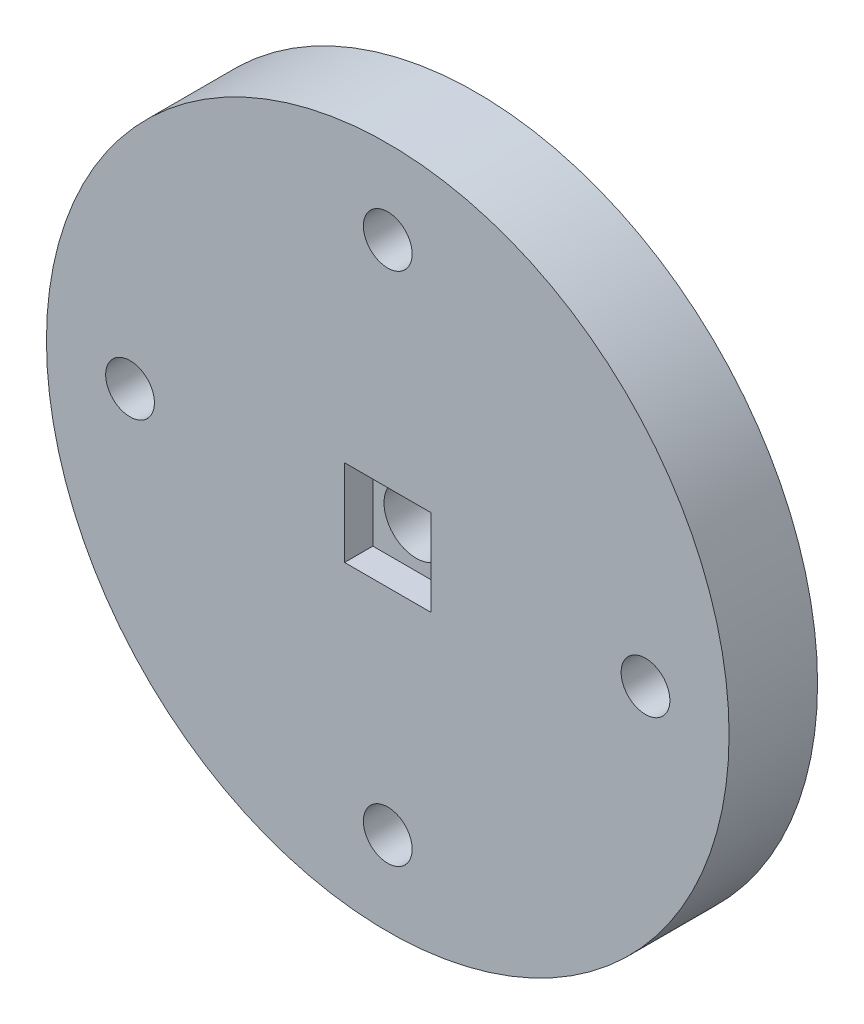
ISO-10303-21;
HEADER;
FILE_DESCRIPTION(('STEP AP214'),'2;1');
FILE_NAME('part.step','',(''),(''),'','','');
FILE_SCHEMA(('AUTOMOTIVE_DESIGN { 1 0 10303 214 1 1 1 1 }'));
ENDSEC;
DATA;
#1=APPLICATION_CONTEXT('core data for automotive mechanical design processes');
#2=APPLICATION_PROTOCOL_DEFINITION('international standard','automotive_design',2000,#1);
#3=PRODUCT_CONTEXT('',#1,'mechanical');
#4=PRODUCT('Part','Part','',(#3));
#5=PRODUCT_RELATED_PRODUCT_CATEGORY('part','',(#4));
#6=PRODUCT_DEFINITION_FORMATION('','',#4);
#7=PRODUCT_DEFINITION_CONTEXT('part definition',#1,'design');
#8=PRODUCT_DEFINITION('design','',#6,#7);
#9=PRODUCT_DEFINITION_SHAPE('','',#8);
#10=(LENGTH_UNIT() NAMED_UNIT(*) SI_UNIT(.MILLI.,.METRE.));
#11=(NAMED_UNIT(*) PLANE_ANGLE_UNIT() SI_UNIT($,.RADIAN.));
#12=(NAMED_UNIT(*) SI_UNIT($,.STERADIAN.) SOLID_ANGLE_UNIT());
#13=UNCERTAINTY_MEASURE_WITH_UNIT(LENGTH_MEASURE(1.E-05),#10,'distance_accuracy_value','');
#14=(GEOMETRIC_REPRESENTATION_CONTEXT(3) GLOBAL_UNCERTAINTY_ASSIGNED_CONTEXT((#13)) GLOBAL_UNIT_ASSIGNED_CONTEXT((#10,
#11,#12)) REPRESENTATION_CONTEXT('',''));
#15=CARTESIAN_POINT('',(0.,0.,0.));
#16=DIRECTION('',(0.,0.,1.));
#17=DIRECTION('',(1.,0.,0.));
#18=AXIS2_PLACEMENT_3D('',#15,#16,#17);
#19=CARTESIAN_POINT('',(0.,3.1,6.35));
#20=DIRECTION('',(0.,-1.,0.));
#21=DIRECTION('',(1.,0.,0.));
#22=AXIS2_PLACEMENT_3D('',#19,#20,#21);
#23=PLANE('',#22);
#24=DIRECTION('',(-1.,0.,0.));
#25=VECTOR('',#24,1.);
#26=CARTESIAN_POINT('',(0.,3.1,4.32));
#27=LINE('',#26,#25);
#28=CARTESIAN_POINT('',(3.1,3.1,4.32));
#29=VERTEX_POINT('',#28);
#30=CARTESIAN_POINT('',(-3.1,3.1,4.32));
#31=VERTEX_POINT('',#30);
#32=EDGE_CURVE('E37',#29,#31,#27,.T.);
#33=ORIENTED_EDGE('',*,*,#32,.F.);
#34=DIRECTION('',(0.,0.,-1.));
#35=VECTOR('',#34,1.);
#36=CARTESIAN_POINT('',(3.1,3.1,6.35));
#37=LINE('',#36,#35);
#38=CARTESIAN_POINT('',(3.1,3.1,6.35));
#39=VERTEX_POINT('',#38);
#40=EDGE_CURVE('E10',#39,#29,#37,.T.);
#41=ORIENTED_EDGE('',*,*,#40,.F.);
#42=DIRECTION('',(-1.,0.,0.));
#43=VECTOR('',#42,1.);
#44=CARTESIAN_POINT('',(0.,3.1,6.35));
#45=LINE('',#44,#43);
#46=CARTESIAN_POINT('',(-3.1,3.1,6.35));
#47=VERTEX_POINT('',#46);
#48=EDGE_CURVE('E94',#39,#47,#45,.T.);
#49=ORIENTED_EDGE('',*,*,#48,.T.);
#50=DIRECTION('',(0.,0.,-1.));
#51=VECTOR('',#50,1.);
#52=CARTESIAN_POINT('',(-3.1,3.1,6.35));
#53=LINE('',#52,#51);
#54=EDGE_CURVE('E83',#47,#31,#53,.T.);
#55=ORIENTED_EDGE('',*,*,#54,.T.);
#56=EDGE_LOOP('',(#33,#41,#49,#55));
#57=FACE_BOUND('',#56,.T.);
#58=ADVANCED_FACE('F16',(#57),#23,.T.);
#59=CARTESIAN_POINT('',(3.1,-0.146196833252908,6.35));
#60=DIRECTION('',(-1.,0.,0.));
#61=DIRECTION('',(0.,-1.,0.));
#62=AXIS2_PLACEMENT_3D('',#59,#60,#61);
#63=PLANE('',#62);
#64=DIRECTION('',(0.,1.,0.));
#65=VECTOR('',#64,1.);
#66=CARTESIAN_POINT('',(3.1,-0.146196833252908,4.32));
#67=LINE('',#66,#65);
#68=CARTESIAN_POINT('',(3.1,-3.1,4.32));
#69=VERTEX_POINT('',#68);
#70=EDGE_CURVE('E71',#69,#29,#67,.T.);
#71=ORIENTED_EDGE('',*,*,#70,.F.);
#72=DIRECTION('',(0.,0.,-1.));
#73=VECTOR('',#72,1.);
#74=CARTESIAN_POINT('',(3.1,-3.1,6.35));
#75=LINE('',#74,#73);
#76=CARTESIAN_POINT('',(3.1,-3.1,6.35));
#77=VERTEX_POINT('',#76);
#78=EDGE_CURVE('E25',#77,#69,#75,.T.);
#79=ORIENTED_EDGE('',*,*,#78,.F.);
#80=DIRECTION('',(0.,1.,0.));
#81=VECTOR('',#80,1.);
#82=CARTESIAN_POINT('',(3.1,-0.146196833252908,6.35));
#83=LINE('',#82,#81);
#84=EDGE_CURVE('E90',#77,#39,#83,.T.);
#85=ORIENTED_EDGE('',*,*,#84,.T.);
#86=ORIENTED_EDGE('',*,*,#40,.T.);
#87=EDGE_LOOP('',(#71,#79,#85,#86));
#88=FACE_BOUND('',#87,.T.);
#89=ADVANCED_FACE('F88',(#88),#63,.T.);
#90=CARTESIAN_POINT('',(0.285954769328236,-3.1,6.35));
#91=DIRECTION('',(0.,-1.,0.));
#92=DIRECTION('',(1.,0.,0.));
#93=AXIS2_PLACEMENT_3D('',#90,#91,#92);
#94=PLANE('',#93);
#95=ORIENTED_EDGE('',*,*,#78,.T.);
#96=DIRECTION('',(-1.,0.,0.));
#97=VECTOR('',#96,1.);
#98=CARTESIAN_POINT('',(0.285954769328236,-3.1,4.32));
#99=LINE('',#98,#97);
#100=CARTESIAN_POINT('',(-3.1,-3.1,4.32));
#101=VERTEX_POINT('',#100);
#102=EDGE_CURVE('E74',#69,#101,#99,.T.);
#103=ORIENTED_EDGE('',*,*,#102,.T.);
#104=DIRECTION('',(0.,0.,-1.));
#105=VECTOR('',#104,1.);
#106=CARTESIAN_POINT('',(-3.1,-3.1,6.35));
#107=LINE('',#106,#105);
#108=CARTESIAN_POINT('',(-3.1,-3.1,6.35));
#109=VERTEX_POINT('',#108);
#110=EDGE_CURVE('E132',#109,#101,#107,.T.);
#111=ORIENTED_EDGE('',*,*,#110,.F.);
#112=DIRECTION('',(-1.,0.,0.));
#113=VECTOR('',#112,1.);
#114=CARTESIAN_POINT('',(0.285954769328236,-3.1,6.35));
#115=LINE('',#114,#113);
#116=EDGE_CURVE('E93',#77,#109,#115,.T.);
#117=ORIENTED_EDGE('',*,*,#116,.F.);
#118=EDGE_LOOP('',(#95,#103,#111,#117));
#119=FACE_BOUND('',#118,.T.);
#120=ADVANCED_FACE('F137',(#119),#94,.F.);
#121=CARTESIAN_POINT('',(-3.1,-0.146196833252908,6.35));
#122=DIRECTION('',(-1.,0.,0.));
#123=DIRECTION('',(0.,-1.,0.));
#124=AXIS2_PLACEMENT_3D('',#121,#122,#123);
#125=PLANE('',#124);
#126=ORIENTED_EDGE('',*,*,#110,.T.);
#127=DIRECTION('',(0.,1.,0.));
#128=VECTOR('',#127,1.);
#129=CARTESIAN_POINT('',(-3.1,-0.146196833252908,4.32));
#130=LINE('',#129,#128);
#131=EDGE_CURVE('E85',#101,#31,#130,.T.);
#132=ORIENTED_EDGE('',*,*,#131,.T.);
#133=ORIENTED_EDGE('',*,*,#54,.F.);
#134=DIRECTION('',(0.,1.,0.));
#135=VECTOR('',#134,1.);
#136=CARTESIAN_POINT('',(-3.1,-0.146196833252908,6.35));
#137=LINE('',#136,#135);
#138=EDGE_CURVE('E49',#109,#47,#137,.T.);
#139=ORIENTED_EDGE('',*,*,#138,.F.);
#140=EDGE_LOOP('',(#126,#132,#133,#139));
#141=FACE_BOUND('',#140,.T.);
#142=ADVANCED_FACE('F192',(#141),#125,.F.);
#143=CARTESIAN_POINT('',(18.5,0.,6.35));
#144=DIRECTION('',(0.,0.,-1.));
#145=DIRECTION('',(-1.,0.,0.));
#146=AXIS2_PLACEMENT_3D('',#143,#144,#145);
#147=CYLINDRICAL_SURFACE('',#146,1.75);
#148=CARTESIAN_POINT('',(18.5,0.,6.35));
#149=DIRECTION('',(0.,0.,1.));
#150=DIRECTION('',(1.,0.,0.));
#151=AXIS2_PLACEMENT_3D('',#148,#149,#150);
#152=CIRCLE('',#151,1.75);
#153=CARTESIAN_POINT('',(20.25,0.,6.35));
#154=VERTEX_POINT('',#153);
#155=EDGE_CURVE('E101',#154,#154,#152,.T.);
#156=ORIENTED_EDGE('',*,*,#155,.T.);
#157=EDGE_LOOP('',(#156));
#158=FACE_BOUND('',#157,.T.);
#159=CARTESIAN_POINT('',(18.5,0.,0.));
#160=DIRECTION('',(0.,0.,1.));
#161=DIRECTION('',(1.,0.,0.));
#162=AXIS2_PLACEMENT_3D('',#159,#160,#161);
#163=CIRCLE('',#162,1.75);
#164=CARTESIAN_POINT('',(20.25,0.,0.));
#165=VERTEX_POINT('',#164);
#166=EDGE_CURVE('E122',#165,#165,#163,.T.);
#167=ORIENTED_EDGE('',*,*,#166,.F.);
#168=EDGE_LOOP('',(#167));
#169=FACE_BOUND('',#168,.T.);
#170=ADVANCED_FACE('F187',(#158,#169),#147,.F.);
#171=CARTESIAN_POINT('',(0.,18.5,6.35));
#172=DIRECTION('',(0.,0.,-1.));
#173=DIRECTION('',(-1.,0.,0.));
#174=AXIS2_PLACEMENT_3D('',#171,#172,#173);
#175=CYLINDRICAL_SURFACE('',#174,1.75);
#176=CARTESIAN_POINT('',(0.,18.5,6.35));
#177=DIRECTION('',(0.,0.,1.));
#178=DIRECTION('',(1.,0.,0.));
#179=AXIS2_PLACEMENT_3D('',#176,#177,#178);
#180=CIRCLE('',#179,1.75);
#181=CARTESIAN_POINT('',(1.75,18.5,6.35));
#182=VERTEX_POINT('',#181);
#183=EDGE_CURVE('E179',#182,#182,#180,.T.);
#184=ORIENTED_EDGE('',*,*,#183,.T.);
#185=EDGE_LOOP('',(#184));
#186=FACE_BOUND('',#185,.T.);
#187=CARTESIAN_POINT('',(0.,18.5,0.));
#188=DIRECTION('',(0.,0.,1.));
#189=DIRECTION('',(1.,0.,0.));
#190=AXIS2_PLACEMENT_3D('',#187,#188,#189);
#191=CIRCLE('',#190,1.75);
#192=CARTESIAN_POINT('',(1.75,18.5,0.));
#193=VERTEX_POINT('',#192);
#194=EDGE_CURVE('E118',#193,#193,#191,.T.);
#195=ORIENTED_EDGE('',*,*,#194,.F.);
#196=EDGE_LOOP('',(#195));
#197=FACE_BOUND('',#196,.T.);
#198=ADVANCED_FACE('F191',(#186,#197),#175,.F.);
#199=CARTESIAN_POINT('',(-18.5,0.,6.35));
#200=DIRECTION('',(0.,0.,-1.));
#201=DIRECTION('',(-1.,0.,0.));
#202=AXIS2_PLACEMENT_3D('',#199,#200,#201);
#203=CYLINDRICAL_SURFACE('',#202,1.75);
#204=CARTESIAN_POINT('',(-18.5,0.,6.35));
#205=DIRECTION('',(0.,0.,1.));
#206=DIRECTION('',(1.,0.,0.));
#207=AXIS2_PLACEMENT_3D('',#204,#205,#206);
#208=CIRCLE('',#207,1.75);
#209=CARTESIAN_POINT('',(-16.75,0.,6.35));
#210=VERTEX_POINT('',#209);
#211=EDGE_CURVE('E175',#210,#210,#208,.T.);
#212=ORIENTED_EDGE('',*,*,#211,.T.);
#213=EDGE_LOOP('',(#212));
#214=FACE_BOUND('',#213,.T.);
#215=CARTESIAN_POINT('',(-18.5,0.,0.));
#216=DIRECTION('',(0.,0.,1.));
#217=DIRECTION('',(1.,0.,0.));
#218=AXIS2_PLACEMENT_3D('',#215,#216,#217);
#219=CIRCLE('',#218,1.75);
#220=CARTESIAN_POINT('',(-16.75,0.,0.));
#221=VERTEX_POINT('',#220);
#222=EDGE_CURVE('E114',#221,#221,#219,.T.);
#223=ORIENTED_EDGE('',*,*,#222,.F.);
#224=EDGE_LOOP('',(#223));
#225=FACE_BOUND('',#224,.T.);
#226=ADVANCED_FACE('F201',(#214,#225),#203,.F.);
#227=CARTESIAN_POINT('',(0.,-18.5,6.35));
#228=DIRECTION('',(0.,0.,-1.));
#229=DIRECTION('',(-1.,0.,0.));
#230=AXIS2_PLACEMENT_3D('',#227,#228,#229);
#231=CYLINDRICAL_SURFACE('',#230,1.75);
#232=CARTESIAN_POINT('',(0.,-18.5,6.35));
#233=DIRECTION('',(0.,0.,1.));
#234=DIRECTION('',(1.,0.,0.));
#235=AXIS2_PLACEMENT_3D('',#232,#233,#234);
#236=CIRCLE('',#235,1.75);
#237=CARTESIAN_POINT('',(1.75000000000001,-18.5,6.35));
#238=VERTEX_POINT('',#237);
#239=EDGE_CURVE('E129',#238,#238,#236,.T.);
#240=ORIENTED_EDGE('',*,*,#239,.T.);
#241=EDGE_LOOP('',(#240));
#242=FACE_BOUND('',#241,.T.);
#243=CARTESIAN_POINT('',(0.,-18.5,0.));
#244=DIRECTION('',(0.,0.,1.));
#245=DIRECTION('',(1.,0.,0.));
#246=AXIS2_PLACEMENT_3D('',#243,#244,#245);
#247=CIRCLE('',#246,1.75);
#248=CARTESIAN_POINT('',(1.75000000000001,-18.5,0.));
#249=VERTEX_POINT('',#248);
#250=EDGE_CURVE('E110',#249,#249,#247,.T.);
#251=ORIENTED_EDGE('',*,*,#250,.F.);
#252=EDGE_LOOP('',(#251));
#253=FACE_BOUND('',#252,.T.);
#254=ADVANCED_FACE('F18',(#242,#253),#231,.F.);
#255=CARTESIAN_POINT('',(0.,0.,6.35));
#256=DIRECTION('',(0.,0.,-1.));
#257=DIRECTION('',(-1.,0.,0.));
#258=AXIS2_PLACEMENT_3D('',#255,#256,#257);
#259=CYLINDRICAL_SURFACE('',#258,24.5);
#260=CARTESIAN_POINT('',(0.,0.,6.35));
#261=DIRECTION('',(0.,0.,1.));
#262=DIRECTION('',(1.,0.,0.));
#263=AXIS2_PLACEMENT_3D('',#260,#261,#262);
#264=CIRCLE('',#263,24.5);
#265=CARTESIAN_POINT('',(24.5,0.,6.35));
#266=VERTEX_POINT('',#265);
#267=EDGE_CURVE('E106',#266,#266,#264,.T.);
#268=ORIENTED_EDGE('',*,*,#267,.F.);
#269=EDGE_LOOP('',(#268));
#270=FACE_BOUND('',#269,.T.);
#271=CARTESIAN_POINT('',(0.,0.,0.));
#272=DIRECTION('',(0.,0.,1.));
#273=DIRECTION('',(1.,0.,0.));
#274=AXIS2_PLACEMENT_3D('',#271,#272,#273);
#275=CIRCLE('',#274,24.5);
#276=CARTESIAN_POINT('',(24.5,0.,0.));
#277=VERTEX_POINT('',#276);
#278=EDGE_CURVE('E126',#277,#277,#275,.T.);
#279=ORIENTED_EDGE('',*,*,#278,.T.);
#280=EDGE_LOOP('',(#279));
#281=FACE_BOUND('',#280,.T.);
#282=ADVANCED_FACE('F143',(#270,#281),#259,.T.);
#283=CARTESIAN_POINT('',(0.,0.,6.35));
#284=DIRECTION('',(0.,0.,1.));
#285=DIRECTION('',(1.,0.,0.));
#286=AXIS2_PLACEMENT_3D('',#283,#284,#285);
#287=PLANE('',#286);
#288=ORIENTED_EDGE('',*,*,#239,.F.);
#289=EDGE_LOOP('',(#288));
#290=FACE_BOUND('',#289,.T.);
#291=ORIENTED_EDGE('',*,*,#211,.F.);
#292=EDGE_LOOP('',(#291));
#293=FACE_BOUND('',#292,.T.);
#294=ORIENTED_EDGE('',*,*,#183,.F.);
#295=EDGE_LOOP('',(#294));
#296=FACE_BOUND('',#295,.T.);
#297=ORIENTED_EDGE('',*,*,#155,.F.);
#298=EDGE_LOOP('',(#297));
#299=FACE_BOUND('',#298,.T.);
#300=ORIENTED_EDGE('',*,*,#48,.F.);
#301=ORIENTED_EDGE('',*,*,#84,.F.);
#302=ORIENTED_EDGE('',*,*,#116,.T.);
#303=ORIENTED_EDGE('',*,*,#138,.T.);
#304=EDGE_LOOP('',(#300,#301,#302,#303));
#305=FACE_BOUND('',#304,.T.);
#306=ORIENTED_EDGE('',*,*,#267,.T.);
#307=EDGE_LOOP('',(#306));
#308=FACE_BOUND('',#307,.T.);
#309=ADVANCED_FACE('F139',(#290,#293,#296,#299,#305,#308),#287,.T.);
#310=CARTESIAN_POINT('',(0.,0.,0.));
#311=DIRECTION('',(0.,0.,1.));
#312=DIRECTION('',(1.,0.,0.));
#313=AXIS2_PLACEMENT_3D('',#310,#311,#312);
#314=PLANE('',#313);
#315=ORIENTED_EDGE('',*,*,#250,.T.);
#316=EDGE_LOOP('',(#315));
#317=FACE_BOUND('',#316,.T.);
#318=ORIENTED_EDGE('',*,*,#222,.T.);
#319=EDGE_LOOP('',(#318));
#320=FACE_BOUND('',#319,.T.);
#321=ORIENTED_EDGE('',*,*,#194,.T.);
#322=EDGE_LOOP('',(#321));
#323=FACE_BOUND('',#322,.T.);
#324=ORIENTED_EDGE('',*,*,#166,.T.);
#325=EDGE_LOOP('',(#324));
#326=FACE_BOUND('',#325,.T.);
#327=ORIENTED_EDGE('',*,*,#278,.F.);
#328=EDGE_LOOP('',(#327));
#329=FACE_BOUND('',#328,.T.);
#330=CARTESIAN_POINT('',(0.,0.,0.));
#331=DIRECTION('',(0.,0.,1.));
#332=DIRECTION('',(1.,0.,0.));
#333=AXIS2_PLACEMENT_3D('',#330,#331,#332);
#334=CIRCLE('',#333,2.3);
#335=CARTESIAN_POINT('',(2.3,0.,0.));
#336=VERTEX_POINT('',#335);
#337=EDGE_CURVE('E160',#336,#336,#334,.T.);
#338=ORIENTED_EDGE('',*,*,#337,.T.);
#339=EDGE_LOOP('',(#338));
#340=FACE_BOUND('',#339,.T.);
#341=ADVANCED_FACE('F142',(#317,#320,#323,#326,#329,#340),#314,.F.);
#342=CARTESIAN_POINT('',(0.,0.,4.32));
#343=DIRECTION('',(0.,0.,-1.));
#344=DIRECTION('',(-1.,0.,0.));
#345=AXIS2_PLACEMENT_3D('',#342,#343,#344);
#346=CYLINDRICAL_SURFACE('',#345,2.3);
#347=CARTESIAN_POINT('',(0.,0.,4.32));
#348=DIRECTION('',(0.,0.,1.));
#349=DIRECTION('',(1.,0.,0.));
#350=AXIS2_PLACEMENT_3D('',#347,#348,#349);
#351=CIRCLE('',#350,2.3);
#352=CARTESIAN_POINT('',(2.3,0.,4.32));
#353=VERTEX_POINT('',#352);
#354=EDGE_CURVE('E78',#353,#353,#351,.T.);
#355=ORIENTED_EDGE('',*,*,#354,.T.);
#356=EDGE_LOOP('',(#355));
#357=FACE_BOUND('',#356,.T.);
#358=ORIENTED_EDGE('',*,*,#337,.F.);
#359=EDGE_LOOP('',(#358));
#360=FACE_BOUND('',#359,.T.);
#361=ADVANCED_FACE('F155',(#357,#360),#346,.F.);
#362=CARTESIAN_POINT('',(0.,0.,4.32));
#363=DIRECTION('',(0.,0.,1.));
#364=DIRECTION('',(1.,0.,0.));
#365=AXIS2_PLACEMENT_3D('',#362,#363,#364);
#366=PLANE('',#365);
#367=ORIENTED_EDGE('',*,*,#354,.F.);
#368=EDGE_LOOP('',(#367));
#369=FACE_BOUND('',#368,.T.);
#370=ORIENTED_EDGE('',*,*,#70,.T.);
#371=ORIENTED_EDGE('',*,*,#32,.T.);
#372=ORIENTED_EDGE('',*,*,#131,.F.);
#373=ORIENTED_EDGE('',*,*,#102,.F.);
#374=EDGE_LOOP('',(#370,#371,#372,#373));
#375=FACE_BOUND('',#374,.T.);
#376=ADVANCED_FACE('F72',(#369,#375),#366,.T.);
#377=CLOSED_SHELL('',(#58,#89,#120,#142,#170,#198,#226,#254,#282,#309,#341,#361,#376));
#378=MANIFOLD_SOLID_BREP('B1',#377);
#379=ADVANCED_BREP_SHAPE_REPRESENTATION('',(#18,#378),#14);
#380=SHAPE_DEFINITION_REPRESENTATION(#9,#379);
ENDSEC;
END-ISO-10303-21;
